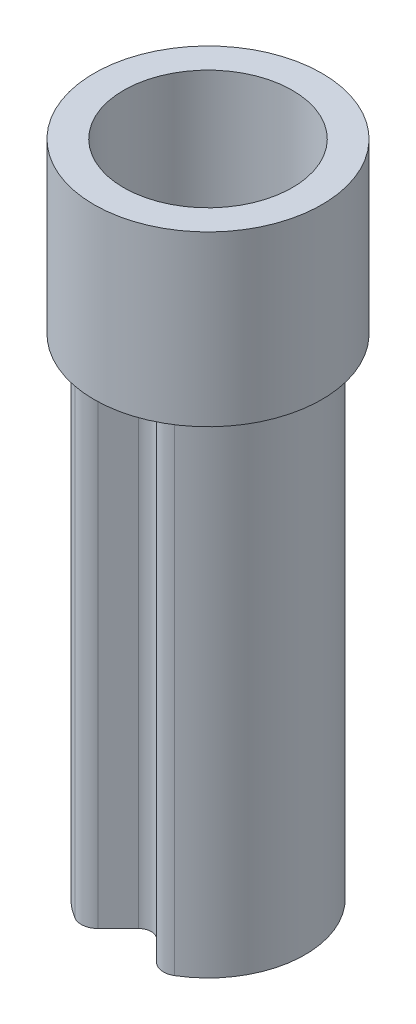
ISO-10303-21;
HEADER;
FILE_DESCRIPTION(('STEP AP214'),'2;1');
FILE_NAME('part.step','',(''),(''),'','','');
FILE_SCHEMA(('AUTOMOTIVE_DESIGN { 1 0 10303 214 1 1 1 1 }'));
ENDSEC;
DATA;
#1=APPLICATION_CONTEXT('core data for automotive mechanical design processes');
#2=APPLICATION_PROTOCOL_DEFINITION('international standard','automotive_design',2000,#1);
#3=PRODUCT_CONTEXT('',#1,'mechanical');
#4=PRODUCT('Part','Part','',(#3));
#5=PRODUCT_RELATED_PRODUCT_CATEGORY('part','',(#4));
#6=PRODUCT_DEFINITION_FORMATION('','',#4);
#7=PRODUCT_DEFINITION_CONTEXT('part definition',#1,'design');
#8=PRODUCT_DEFINITION('design','',#6,#7);
#9=PRODUCT_DEFINITION_SHAPE('','',#8);
#10=(LENGTH_UNIT() NAMED_UNIT(*) SI_UNIT(.MILLI.,.METRE.));
#11=(NAMED_UNIT(*) PLANE_ANGLE_UNIT() SI_UNIT($,.RADIAN.));
#12=(NAMED_UNIT(*) SI_UNIT($,.STERADIAN.) SOLID_ANGLE_UNIT());
#13=UNCERTAINTY_MEASURE_WITH_UNIT(LENGTH_MEASURE(1.E-05),#10,'distance_accuracy_value','');
#14=(GEOMETRIC_REPRESENTATION_CONTEXT(3) GLOBAL_UNCERTAINTY_ASSIGNED_CONTEXT((#13)) GLOBAL_UNIT_ASSIGNED_CONTEXT((#10,
#11,#12)) REPRESENTATION_CONTEXT('',''));
#15=CARTESIAN_POINT('',(0.,0.,0.));
#16=DIRECTION('',(0.,0.,1.));
#17=DIRECTION('',(1.,0.,0.));
#18=AXIS2_PLACEMENT_3D('',#15,#16,#17);
#19=CARTESIAN_POINT('',(0.,5.8,0.822132034355964));
#20=DIRECTION('',(0.,1.,0.));
#21=DIRECTION('',(0.,0.,1.));
#22=AXIS2_PLACEMENT_3D('',#19,#20,#21);
#23=PLANE('',#22);
#24=DIRECTION('',(0.707106781186548,0.,0.707106781186548));
#25=VECTOR('',#24,1.);
#26=CARTESIAN_POINT('',(0.106066017177983,5.8,0.716066017177983));
#27=LINE('',#26,#25);
#28=CARTESIAN_POINT('',(0.106066017177983,5.8,0.716066017177983));
#29=VERTEX_POINT('',#28);
#30=CARTESIAN_POINT('',(0.332945922473057,5.8,0.942945922473057));
#31=VERTEX_POINT('',#30);
#32=EDGE_CURVE('E154',#29,#31,#27,.T.);
#33=ORIENTED_EDGE('',*,*,#32,.T.);
#34=CARTESIAN_POINT('',(0.,5.8,0.));
#35=DIRECTION('',(0.,1.,0.));
#36=DIRECTION('',(0.,0.,1.));
#37=AXIS2_PLACEMENT_3D('',#34,#35,#36);
#38=CIRCLE('',#37,1.);
#39=CARTESIAN_POINT('',(0.513633561053512,5.8,0.858009653185492));
#40=VERTEX_POINT('',#39);
#41=EDGE_CURVE('E137',#31,#40,#38,.T.);
#42=ORIENTED_EDGE('',*,*,#41,.T.);
#43=CARTESIAN_POINT('',(0.487951883000837,5.8,0.815109170526217));
#44=DIRECTION('',(0.,1.,0.));
#45=DIRECTION('',(0.,0.,1.));
#46=AXIS2_PLACEMENT_3D('',#43,#44,#45);
#47=CIRCLE('',#46,0.05);
#48=CARTESIAN_POINT('',(0.452596543941509,5.8,0.850464509585545));
#49=VERTEX_POINT('',#48);
#50=EDGE_CURVE('E194',#40,#49,#47,.F.);
#51=ORIENTED_EDGE('',*,*,#50,.T.);
#52=DIRECTION('',(0.707106781186548,0.,0.707106781186547));
#53=VECTOR('',#52,1.);
#54=CARTESIAN_POINT('',(0.212132034355966,5.8,0.610000000000001));
#55=LINE('',#54,#53);
#56=CARTESIAN_POINT('',(0.212132034355966,5.8,0.610000000000002));
#57=VERTEX_POINT('',#56);
#58=EDGE_CURVE('E227',#57,#49,#55,.T.);
#59=ORIENTED_EDGE('',*,*,#58,.F.);
#60=CARTESIAN_POINT('',(0.,5.8,0.822132034355964));
#61=DIRECTION('',(0.,-1.,0.));
#62=DIRECTION('',(0.,0.,1.));
#63=AXIS2_PLACEMENT_3D('',#60,#61,#62);
#64=CIRCLE('',#63,0.3);
#65=CARTESIAN_POINT('',(-0.212132034355965,5.8,0.610000000000001));
#66=VERTEX_POINT('',#65);
#67=EDGE_CURVE('E223',#66,#57,#64,.T.);
#68=ORIENTED_EDGE('',*,*,#67,.F.);
#69=DIRECTION('',(0.707106781186547,0.,-0.707106781186548));
#70=VECTOR('',#69,1.);
#71=CARTESIAN_POINT('',(-0.479612456619358,5.8,0.877480422263394));
#72=LINE('',#71,#70);
#73=CARTESIAN_POINT('',(-0.452596543941509,5.8,0.850464509585545));
#74=VERTEX_POINT('',#73);
#75=EDGE_CURVE('E221',#74,#66,#72,.T.);
#76=ORIENTED_EDGE('',*,*,#75,.F.);
#77=CARTESIAN_POINT('',(-0.487951883000836,5.8,0.815109170526218));
#78=DIRECTION('',(0.,1.,0.));
#79=DIRECTION('',(0.,0.,1.));
#80=AXIS2_PLACEMENT_3D('',#77,#78,#79);
#81=CIRCLE('',#80,0.05);
#82=CARTESIAN_POINT('',(-0.513633561053512,5.8,0.858009653185492));
#83=VERTEX_POINT('',#82);
#84=EDGE_CURVE('E197',#74,#83,#81,.F.);
#85=ORIENTED_EDGE('',*,*,#84,.T.);
#86=CARTESIAN_POINT('',(-0.332945922473057,5.8,0.942945922473057));
#87=VERTEX_POINT('',#86);
#88=EDGE_CURVE('E12',#83,#87,#38,.T.);
#89=ORIENTED_EDGE('',*,*,#88,.T.);
#90=DIRECTION('',(0.707106781186547,0.,-0.707106781186548));
#91=VECTOR('',#90,1.);
#92=CARTESIAN_POINT('',(-0.448807004477936,5.8,1.05880700447794));
#93=LINE('',#92,#91);
#94=CARTESIAN_POINT('',(-0.106066017177983,5.8,0.716066017177983));
#95=VERTEX_POINT('',#94);
#96=EDGE_CURVE('E164',#87,#95,#93,.T.);
#97=ORIENTED_EDGE('',*,*,#96,.T.);
#98=CARTESIAN_POINT('',(0.,5.8,0.822132034355964));
#99=DIRECTION('',(0.,-1.,0.));
#100=DIRECTION('',(0.,0.,1.));
#101=AXIS2_PLACEMENT_3D('',#98,#99,#100);
#102=CIRCLE('',#101,0.15);
#103=EDGE_CURVE('E159',#95,#29,#102,.T.);
#104=ORIENTED_EDGE('',*,*,#103,.T.);
#105=EDGE_LOOP('',(#33,#42,#51,#59,#68,#76,#85,#89,#97,#104));
#106=FACE_BOUND('',#105,.T.);
#107=ADVANCED_FACE('F36',(#106),#23,.T.);
#108=CARTESIAN_POINT('',(0.,0.,0.822132034355964));
#109=DIRECTION('',(0.,1.,0.));
#110=DIRECTION('',(0.,0.,1.));
#111=AXIS2_PLACEMENT_3D('',#108,#109,#110);
#112=PLANE('',#111);
#113=CARTESIAN_POINT('',(0.,0.,0.));
#114=DIRECTION('',(0.,1.,0.));
#115=DIRECTION('',(0.,0.,1.));
#116=AXIS2_PLACEMENT_3D('',#113,#114,#115);
#117=CIRCLE('',#116,1.15);
#118=CARTESIAN_POINT('',(0.590678595211539,0.,0.986711101163316));
#119=VERTEX_POINT('',#118);
#120=CARTESIAN_POINT('',(-0.590678595211538,0.,0.986711101163316));
#121=VERTEX_POINT('',#120);
#122=EDGE_CURVE('E177',#119,#121,#117,.T.);
#123=ORIENTED_EDGE('',*,*,#122,.F.);
#124=CARTESIAN_POINT('',(0.487951883000836,0.,0.815109170526217));
#125=DIRECTION('',(0.,1.,0.));
#126=DIRECTION('',(0.,0.,1.));
#127=AXIS2_PLACEMENT_3D('',#124,#125,#126);
#128=CIRCLE('',#127,0.2);
#129=CARTESIAN_POINT('',(0.346530526763527,0.,0.956530526763527));
#130=VERTEX_POINT('',#129);
#131=EDGE_CURVE('E61',#119,#130,#128,.F.);
#132=ORIENTED_EDGE('',*,*,#131,.T.);
#133=DIRECTION('',(0.707106781186548,0.,0.707106781186548));
#134=VECTOR('',#133,1.);
#135=CARTESIAN_POINT('',(0.106066017177983,0.,0.716066017177983));
#136=LINE('',#135,#134);
#137=CARTESIAN_POINT('',(0.106066017177983,0.,0.716066017177983));
#138=VERTEX_POINT('',#137);
#139=EDGE_CURVE('E174',#138,#130,#136,.T.);
#140=ORIENTED_EDGE('',*,*,#139,.F.);
#141=CARTESIAN_POINT('',(0.,0.,0.822132034355964));
#142=DIRECTION('',(0.,-1.,0.));
#143=DIRECTION('',(0.,0.,1.));
#144=AXIS2_PLACEMENT_3D('',#141,#142,#143);
#145=CIRCLE('',#144,0.15);
#146=CARTESIAN_POINT('',(-0.106066017177983,0.,0.716066017177983));
#147=VERTEX_POINT('',#146);
#148=EDGE_CURVE('E171',#147,#138,#145,.T.);
#149=ORIENTED_EDGE('',*,*,#148,.F.);
#150=DIRECTION('',(0.707106781186547,0.,-0.707106781186548));
#151=VECTOR('',#150,1.);
#152=CARTESIAN_POINT('',(-0.448807004477936,0.,1.05880700447794));
#153=LINE('',#152,#151);
#154=CARTESIAN_POINT('',(-0.346530526763527,0.,0.956530526763527));
#155=VERTEX_POINT('',#154);
#156=EDGE_CURVE('E180',#155,#147,#153,.T.);
#157=ORIENTED_EDGE('',*,*,#156,.F.);
#158=CARTESIAN_POINT('',(-0.487951883000836,0.,0.815109170526218));
#159=DIRECTION('',(0.,1.,0.));
#160=DIRECTION('',(0.,0.,1.));
#161=AXIS2_PLACEMENT_3D('',#158,#159,#160);
#162=CIRCLE('',#161,0.2);
#163=EDGE_CURVE('E204',#155,#121,#162,.F.);
#164=ORIENTED_EDGE('',*,*,#163,.T.);
#165=EDGE_LOOP('',(#123,#132,#140,#149,#157,#164));
#166=FACE_BOUND('',#165,.T.);
#167=DIRECTION('',(0.707106781186548,0.,0.707106781186547));
#168=VECTOR('',#167,1.);
#169=CARTESIAN_POINT('',(0.212132034355966,0.,0.610000000000001));
#170=LINE('',#169,#168);
#171=CARTESIAN_POINT('',(0.212132034355966,0.,0.610000000000002));
#172=VERTEX_POINT('',#171);
#173=CARTESIAN_POINT('',(0.452596543941509,0.,0.850464509585545));
#174=VERTEX_POINT('',#173);
#175=EDGE_CURVE('E224',#172,#174,#170,.T.);
#176=ORIENTED_EDGE('',*,*,#175,.T.);
#177=CARTESIAN_POINT('',(0.487951883000837,0.,0.815109170526217));
#178=DIRECTION('',(0.,1.,0.));
#179=DIRECTION('',(0.,0.,1.));
#180=AXIS2_PLACEMENT_3D('',#177,#178,#179);
#181=CIRCLE('',#180,0.05);
#182=CARTESIAN_POINT('',(0.513633561053512,0.,0.858009653185492));
#183=VERTEX_POINT('',#182);
#184=EDGE_CURVE('E192',#174,#183,#181,.T.);
#185=ORIENTED_EDGE('',*,*,#184,.T.);
#186=CARTESIAN_POINT('',(0.,0.,0.));
#187=DIRECTION('',(0.,1.,0.));
#188=DIRECTION('',(0.,0.,1.));
#189=AXIS2_PLACEMENT_3D('',#186,#187,#188);
#190=CIRCLE('',#189,1.);
#191=CARTESIAN_POINT('',(-0.513633561053512,0.,0.858009653185492));
#192=VERTEX_POINT('',#191);
#193=EDGE_CURVE('E231',#183,#192,#190,.T.);
#194=ORIENTED_EDGE('',*,*,#193,.T.);
#195=CARTESIAN_POINT('',(-0.487951883000836,0.,0.815109170526218));
#196=DIRECTION('',(0.,1.,0.));
#197=DIRECTION('',(0.,0.,1.));
#198=AXIS2_PLACEMENT_3D('',#195,#196,#197);
#199=CIRCLE('',#198,0.05);
#200=CARTESIAN_POINT('',(-0.452596543941509,0.,0.850464509585545));
#201=VERTEX_POINT('',#200);
#202=EDGE_CURVE('E195',#192,#201,#199,.T.);
#203=ORIENTED_EDGE('',*,*,#202,.T.);
#204=DIRECTION('',(0.707106781186547,0.,-0.707106781186548));
#205=VECTOR('',#204,1.);
#206=CARTESIAN_POINT('',(-0.479612456619358,0.,0.877480422263394));
#207=LINE('',#206,#205);
#208=CARTESIAN_POINT('',(-0.212132034355965,0.,0.610000000000001));
#209=VERTEX_POINT('',#208);
#210=EDGE_CURVE('E234',#201,#209,#207,.T.);
#211=ORIENTED_EDGE('',*,*,#210,.T.);
#212=CARTESIAN_POINT('',(0.,0.,0.822132034355964));
#213=DIRECTION('',(0.,-1.,0.));
#214=DIRECTION('',(0.,0.,1.));
#215=AXIS2_PLACEMENT_3D('',#212,#213,#214);
#216=CIRCLE('',#215,0.3);
#217=EDGE_CURVE('E237',#209,#172,#216,.T.);
#218=ORIENTED_EDGE('',*,*,#217,.T.);
#219=EDGE_LOOP('',(#176,#185,#194,#203,#211,#218));
#220=FACE_BOUND('',#219,.T.);
#221=ADVANCED_FACE('F255',(#166,#220),#112,.F.);
#222=CARTESIAN_POINT('',(0.,5.8,0.822132034355964));
#223=DIRECTION('',(0.,-1.,0.));
#224=DIRECTION('',(0.,0.,-1.));
#225=AXIS2_PLACEMENT_3D('',#222,#223,#224);
#226=CYLINDRICAL_SURFACE('',#225,0.15);
#227=ORIENTED_EDGE('',*,*,#148,.T.);
#228=DIRECTION('',(0.,-1.,0.));
#229=VECTOR('',#228,1.);
#230=CARTESIAN_POINT('',(0.106066017177983,5.8,0.716066017177983));
#231=LINE('',#230,#229);
#232=EDGE_CURVE('E184',#29,#138,#231,.T.);
#233=ORIENTED_EDGE('',*,*,#232,.F.);
#234=ORIENTED_EDGE('',*,*,#103,.F.);
#235=DIRECTION('',(0.,-1.,0.));
#236=VECTOR('',#235,1.);
#237=CARTESIAN_POINT('',(-0.106066017177983,5.8,0.716066017177983));
#238=LINE('',#237,#236);
#239=EDGE_CURVE('E170',#95,#147,#238,.T.);
#240=ORIENTED_EDGE('',*,*,#239,.T.);
#241=EDGE_LOOP('',(#227,#233,#234,#240));
#242=FACE_BOUND('',#241,.T.);
#243=ADVANCED_FACE('F291',(#242),#226,.F.);
#244=CARTESIAN_POINT('',(0.106066017177983,5.8,0.716066017177983));
#245=DIRECTION('',(0.707106781186547,0.,-0.707106781186547));
#246=DIRECTION('',(-0.707106781186548,0.,-0.707106781186548));
#247=AXIS2_PLACEMENT_3D('',#244,#245,#246);
#248=PLANE('',#247);
#249=ORIENTED_EDGE('',*,*,#139,.T.);
#250=DIRECTION('',(0.,-1.,0.));
#251=VECTOR('',#250,1.);
#252=CARTESIAN_POINT('',(0.346530526763527,5.8,0.956530526763527));
#253=LINE('',#252,#251);
#254=CARTESIAN_POINT('',(0.346530526763527,5.8,0.956530526763527));
#255=VERTEX_POINT('',#254);
#256=EDGE_CURVE('E157',#130,#255,#253,.F.);
#257=ORIENTED_EDGE('',*,*,#256,.T.);
#258=EDGE_CURVE('E133',#31,#255,#27,.T.);
#259=ORIENTED_EDGE('',*,*,#258,.F.);
#260=ORIENTED_EDGE('',*,*,#32,.F.);
#261=ORIENTED_EDGE('',*,*,#232,.T.);
#262=EDGE_LOOP('',(#249,#257,#259,#260,#261));
#263=FACE_BOUND('',#262,.T.);
#264=ADVANCED_FACE('F152',(#263),#248,.F.);
#265=CARTESIAN_POINT('',(0.,5.8,0.));
#266=DIRECTION('',(0.,-1.,0.));
#267=DIRECTION('',(0.,0.,-1.));
#268=AXIS2_PLACEMENT_3D('',#265,#266,#267);
#269=CYLINDRICAL_SURFACE('',#268,1.15);
#270=CARTESIAN_POINT('',(0.,5.8,0.));
#271=DIRECTION('',(0.,1.,0.));
#272=DIRECTION('',(0.,0.,1.));
#273=AXIS2_PLACEMENT_3D('',#270,#271,#272);
#274=CIRCLE('',#273,1.15);
#275=CARTESIAN_POINT('',(0.590678595211539,5.8,0.986711101163316));
#276=VERTEX_POINT('',#275);
#277=CARTESIAN_POINT('',(-0.590678595211538,5.8,0.986711101163316));
#278=VERTEX_POINT('',#277);
#279=EDGE_CURVE('E163',#276,#278,#274,.T.);
#280=ORIENTED_EDGE('',*,*,#279,.F.);
#281=DIRECTION('',(0.,-1.,0.));
#282=VECTOR('',#281,1.);
#283=CARTESIAN_POINT('',(0.590678595211539,5.8,0.986711101163316));
#284=LINE('',#283,#282);
#285=EDGE_CURVE('E201',#276,#119,#284,.T.);
#286=ORIENTED_EDGE('',*,*,#285,.T.);
#287=ORIENTED_EDGE('',*,*,#122,.T.);
#288=DIRECTION('',(0.,-1.,0.));
#289=VECTOR('',#288,1.);
#290=CARTESIAN_POINT('',(-0.590678595211539,5.8,0.986711101163316));
#291=LINE('',#290,#289);
#292=EDGE_CURVE('E198',#121,#278,#291,.F.);
#293=ORIENTED_EDGE('',*,*,#292,.T.);
#294=EDGE_LOOP('',(#280,#286,#287,#293));
#295=FACE_BOUND('',#294,.T.);
#296=ADVANCED_FACE('F299',(#295),#269,.T.);
#297=CARTESIAN_POINT('',(-0.448807004477936,5.8,1.05880700447794));
#298=DIRECTION('',(-0.707106781186548,0.,-0.707106781186547));
#299=DIRECTION('',(-0.707106781186547,0.,0.707106781186548));
#300=AXIS2_PLACEMENT_3D('',#297,#298,#299);
#301=PLANE('',#300);
#302=CARTESIAN_POINT('',(-0.346530526763527,5.8,0.956530526763527));
#303=VERTEX_POINT('',#302);
#304=EDGE_CURVE('E136',#303,#87,#93,.T.);
#305=ORIENTED_EDGE('',*,*,#304,.F.);
#306=DIRECTION('',(0.,-1.,0.));
#307=VECTOR('',#306,1.);
#308=CARTESIAN_POINT('',(-0.346530526763527,5.8,0.956530526763527));
#309=LINE('',#308,#307);
#310=EDGE_CURVE('E45',#303,#155,#309,.T.);
#311=ORIENTED_EDGE('',*,*,#310,.T.);
#312=ORIENTED_EDGE('',*,*,#156,.T.);
#313=ORIENTED_EDGE('',*,*,#239,.F.);
#314=ORIENTED_EDGE('',*,*,#96,.F.);
#315=EDGE_LOOP('',(#305,#311,#312,#313,#314));
#316=FACE_BOUND('',#315,.T.);
#317=ADVANCED_FACE('F296',(#316),#301,.F.);
#318=CARTESIAN_POINT('',(0.,5.8,0.));
#319=DIRECTION('',(0.,-1.,0.));
#320=DIRECTION('',(0.,0.,-1.));
#321=AXIS2_PLACEMENT_3D('',#318,#319,#320);
#322=CYLINDRICAL_SURFACE('',#321,1.);
#323=ORIENTED_EDGE('',*,*,#193,.F.);
#324=DIRECTION('',(0.,-1.,0.));
#325=VECTOR('',#324,1.);
#326=CARTESIAN_POINT('',(0.513633561053512,5.8,0.858009653185492));
#327=LINE('',#326,#325);
#328=EDGE_CURVE('E145',#183,#40,#327,.F.);
#329=ORIENTED_EDGE('',*,*,#328,.T.);
#330=ORIENTED_EDGE('',*,*,#41,.F.);
#331=EDGE_CURVE('E53',#87,#31,#38,.T.);
#332=ORIENTED_EDGE('',*,*,#331,.F.);
#333=ORIENTED_EDGE('',*,*,#88,.F.);
#334=DIRECTION('',(0.,-1.,0.));
#335=VECTOR('',#334,1.);
#336=CARTESIAN_POINT('',(-0.513633561053512,5.8,0.858009653185492));
#337=LINE('',#336,#335);
#338=EDGE_CURVE('E189',#83,#192,#337,.T.);
#339=ORIENTED_EDGE('',*,*,#338,.T.);
#340=EDGE_LOOP('',(#323,#329,#330,#332,#333,#339));
#341=FACE_BOUND('',#340,.T.);
#342=CARTESIAN_POINT('',(0.,7.8,0.));
#343=DIRECTION('',(0.,1.,0.));
#344=DIRECTION('',(0.,0.,1.));
#345=AXIS2_PLACEMENT_3D('',#342,#343,#344);
#346=CIRCLE('',#345,1.);
#347=CARTESIAN_POINT('',(0.,7.8,1.));
#348=VERTEX_POINT('',#347);
#349=EDGE_CURVE('E138',#348,#348,#346,.T.);
#350=ORIENTED_EDGE('',*,*,#349,.T.);
#351=EDGE_LOOP('',(#350));
#352=FACE_BOUND('',#351,.T.);
#353=ADVANCED_FACE('F142',(#341,#352),#322,.F.);
#354=CARTESIAN_POINT('',(-0.479612456619358,5.8,0.877480422263394));
#355=DIRECTION('',(-0.707106781186548,0.,-0.707106781186547));
#356=DIRECTION('',(-0.707106781186547,0.,0.707106781186548));
#357=AXIS2_PLACEMENT_3D('',#354,#355,#356);
#358=PLANE('',#357);
#359=ORIENTED_EDGE('',*,*,#210,.F.);
#360=DIRECTION('',(0.,1.,0.));
#361=VECTOR('',#360,1.);
#362=CARTESIAN_POINT('',(-0.452596543941509,5.8,0.850464509585545));
#363=LINE('',#362,#361);
#364=EDGE_CURVE('E190',#201,#74,#363,.T.);
#365=ORIENTED_EDGE('',*,*,#364,.T.);
#366=ORIENTED_EDGE('',*,*,#75,.T.);
#367=DIRECTION('',(0.,-1.,0.));
#368=VECTOR('',#367,1.);
#369=CARTESIAN_POINT('',(-0.212132034355965,5.8,0.610000000000001));
#370=LINE('',#369,#368);
#371=EDGE_CURVE('E175',#66,#209,#370,.T.);
#372=ORIENTED_EDGE('',*,*,#371,.T.);
#373=EDGE_LOOP('',(#359,#365,#366,#372));
#374=FACE_BOUND('',#373,.T.);
#375=ADVANCED_FACE('F247',(#374),#358,.T.);
#376=CARTESIAN_POINT('',(0.,5.8,0.822132034355964));
#377=DIRECTION('',(0.,-1.,0.));
#378=DIRECTION('',(0.,0.,-1.));
#379=AXIS2_PLACEMENT_3D('',#376,#377,#378);
#380=CYLINDRICAL_SURFACE('',#379,0.3);
#381=ORIENTED_EDGE('',*,*,#217,.F.);
#382=ORIENTED_EDGE('',*,*,#371,.F.);
#383=ORIENTED_EDGE('',*,*,#67,.T.);
#384=DIRECTION('',(0.,-1.,0.));
#385=VECTOR('',#384,1.);
#386=CARTESIAN_POINT('',(0.212132034355966,5.8,0.610000000000002));
#387=LINE('',#386,#385);
#388=EDGE_CURVE('E230',#57,#172,#387,.T.);
#389=ORIENTED_EDGE('',*,*,#388,.T.);
#390=EDGE_LOOP('',(#381,#382,#383,#389));
#391=FACE_BOUND('',#390,.T.);
#392=ADVANCED_FACE('F252',(#391),#380,.T.);
#393=CARTESIAN_POINT('',(0.212132034355966,5.8,0.610000000000001));
#394=DIRECTION('',(0.707106781186547,0.,-0.707106781186548));
#395=DIRECTION('',(-0.707106781186548,0.,-0.707106781186547));
#396=AXIS2_PLACEMENT_3D('',#393,#394,#395);
#397=PLANE('',#396);
#398=ORIENTED_EDGE('',*,*,#58,.T.);
#399=DIRECTION('',(0.,1.,0.));
#400=VECTOR('',#399,1.);
#401=CARTESIAN_POINT('',(0.452596543941509,0.,0.850464509585545));
#402=LINE('',#401,#400);
#403=EDGE_CURVE('E186',#49,#174,#402,.F.);
#404=ORIENTED_EDGE('',*,*,#403,.T.);
#405=ORIENTED_EDGE('',*,*,#175,.F.);
#406=ORIENTED_EDGE('',*,*,#388,.F.);
#407=EDGE_LOOP('',(#398,#404,#405,#406));
#408=FACE_BOUND('',#407,.T.);
#409=ADVANCED_FACE('F274',(#408),#397,.T.);
#410=CARTESIAN_POINT('',(0.487951883000837,5.8,0.815109170526217));
#411=DIRECTION('',(0.,-1.,0.));
#412=DIRECTION('',(0.,0.,-1.));
#413=AXIS2_PLACEMENT_3D('',#410,#411,#412);
#414=CYLINDRICAL_SURFACE('',#413,0.05);
#415=ORIENTED_EDGE('',*,*,#50,.F.);
#416=ORIENTED_EDGE('',*,*,#328,.F.);
#417=ORIENTED_EDGE('',*,*,#184,.F.);
#418=ORIENTED_EDGE('',*,*,#403,.F.);
#419=EDGE_LOOP('',(#415,#416,#417,#418));
#420=FACE_BOUND('',#419,.T.);
#421=ADVANCED_FACE('F275',(#420),#414,.F.);
#422=CARTESIAN_POINT('',(-0.487951883000836,5.8,0.815109170526218));
#423=DIRECTION('',(0.,-1.,0.));
#424=DIRECTION('',(0.,0.,-1.));
#425=AXIS2_PLACEMENT_3D('',#422,#423,#424);
#426=CYLINDRICAL_SURFACE('',#425,0.05);
#427=ORIENTED_EDGE('',*,*,#84,.F.);
#428=ORIENTED_EDGE('',*,*,#364,.F.);
#429=ORIENTED_EDGE('',*,*,#202,.F.);
#430=ORIENTED_EDGE('',*,*,#338,.F.);
#431=EDGE_LOOP('',(#427,#428,#429,#430));
#432=FACE_BOUND('',#431,.T.);
#433=ADVANCED_FACE('F260',(#432),#426,.F.);
#434=CARTESIAN_POINT('',(0.487951883000836,5.8,0.815109170526217));
#435=DIRECTION('',(0.,-1.,0.));
#436=DIRECTION('',(0.,0.,-1.));
#437=AXIS2_PLACEMENT_3D('',#434,#435,#436);
#438=CYLINDRICAL_SURFACE('',#437,0.2);
#439=CARTESIAN_POINT('',(0.487951883000836,5.8,0.815109170526217));
#440=DIRECTION('',(0.,1.,0.));
#441=DIRECTION('',(0.,0.,1.));
#442=AXIS2_PLACEMENT_3D('',#439,#440,#441);
#443=CIRCLE('',#442,0.2);
#444=EDGE_CURVE('E210',#255,#276,#443,.T.);
#445=ORIENTED_EDGE('',*,*,#444,.F.);
#446=ORIENTED_EDGE('',*,*,#256,.F.);
#447=ORIENTED_EDGE('',*,*,#131,.F.);
#448=ORIENTED_EDGE('',*,*,#285,.F.);
#449=EDGE_LOOP('',(#445,#446,#447,#448));
#450=FACE_BOUND('',#449,.T.);
#451=ADVANCED_FACE('F282',(#450),#438,.T.);
#452=CARTESIAN_POINT('',(-0.487951883000836,5.8,0.815109170526218));
#453=DIRECTION('',(0.,-1.,0.));
#454=DIRECTION('',(0.,0.,-1.));
#455=AXIS2_PLACEMENT_3D('',#452,#453,#454);
#456=CYLINDRICAL_SURFACE('',#455,0.2);
#457=CARTESIAN_POINT('',(-0.487951883000836,5.8,0.815109170526218));
#458=DIRECTION('',(0.,1.,0.));
#459=DIRECTION('',(0.,0.,1.));
#460=AXIS2_PLACEMENT_3D('',#457,#458,#459);
#461=CIRCLE('',#460,0.2);
#462=EDGE_CURVE('E208',#278,#303,#461,.T.);
#463=ORIENTED_EDGE('',*,*,#462,.F.);
#464=ORIENTED_EDGE('',*,*,#292,.F.);
#465=ORIENTED_EDGE('',*,*,#163,.F.);
#466=ORIENTED_EDGE('',*,*,#310,.F.);
#467=EDGE_LOOP('',(#463,#464,#465,#466));
#468=FACE_BOUND('',#467,.T.);
#469=ADVANCED_FACE('F38',(#468),#456,.T.);
#470=CARTESIAN_POINT('',(0.,5.8,0.));
#471=DIRECTION('',(0.,1.,0.));
#472=DIRECTION('',(0.,0.,1.));
#473=AXIS2_PLACEMENT_3D('',#470,#471,#472);
#474=PLANE('',#473);
#475=CARTESIAN_POINT('',(0.,5.8,0.));
#476=DIRECTION('',(0.,1.,0.));
#477=DIRECTION('',(0.,0.,1.));
#478=AXIS2_PLACEMENT_3D('',#475,#476,#477);
#479=CIRCLE('',#478,1.35);
#480=CARTESIAN_POINT('',(0.,5.8,1.35));
#481=VERTEX_POINT('',#480);
#482=EDGE_CURVE('E149',#481,#481,#479,.T.);
#483=ORIENTED_EDGE('',*,*,#482,.F.);
#484=EDGE_LOOP('',(#483));
#485=FACE_BOUND('',#484,.T.);
#486=ORIENTED_EDGE('',*,*,#331,.T.);
#487=ORIENTED_EDGE('',*,*,#258,.T.);
#488=ORIENTED_EDGE('',*,*,#444,.T.);
#489=ORIENTED_EDGE('',*,*,#279,.T.);
#490=ORIENTED_EDGE('',*,*,#462,.T.);
#491=ORIENTED_EDGE('',*,*,#304,.T.);
#492=EDGE_LOOP('',(#486,#487,#488,#489,#490,#491));
#493=FACE_BOUND('',#492,.T.);
#494=ADVANCED_FACE('F131',(#485,#493),#474,.F.);
#495=CARTESIAN_POINT('',(0.,19.4183766184074,0.));
#496=DIRECTION('',(0.,-1.,0.));
#497=DIRECTION('',(0.,0.,-1.));
#498=AXIS2_PLACEMENT_3D('',#495,#496,#497);
#499=CYLINDRICAL_SURFACE('',#498,1.35);
#500=ORIENTED_EDGE('',*,*,#482,.T.);
#501=EDGE_LOOP('',(#500));
#502=FACE_BOUND('',#501,.T.);
#503=CARTESIAN_POINT('',(0.,7.8,0.));
#504=DIRECTION('',(0.,1.,0.));
#505=DIRECTION('',(0.,0.,1.));
#506=AXIS2_PLACEMENT_3D('',#503,#504,#505);
#507=CIRCLE('',#506,1.35);
#508=CARTESIAN_POINT('',(0.,7.8,1.35));
#509=VERTEX_POINT('',#508);
#510=EDGE_CURVE('E235',#509,#509,#507,.T.);
#511=ORIENTED_EDGE('',*,*,#510,.F.);
#512=EDGE_LOOP('',(#511));
#513=FACE_BOUND('',#512,.T.);
#514=ADVANCED_FACE('F325',(#502,#513),#499,.T.);
#515=CARTESIAN_POINT('',(0.,7.8,0.822132034355964));
#516=DIRECTION('',(0.,1.,0.));
#517=DIRECTION('',(0.,0.,1.));
#518=AXIS2_PLACEMENT_3D('',#515,#516,#517);
#519=PLANE('',#518);
#520=ORIENTED_EDGE('',*,*,#349,.F.);
#521=EDGE_LOOP('',(#520));
#522=FACE_BOUND('',#521,.T.);
#523=ORIENTED_EDGE('',*,*,#510,.T.);
#524=EDGE_LOOP('',(#523));
#525=FACE_BOUND('',#524,.T.);
#526=ADVANCED_FACE('F407',(#522,#525),#519,.T.);
#527=CLOSED_SHELL('',(#107,#221,#243,#264,#296,#317,#353,#375,#392,#409,#421,#433,#451,#469,
#494,#514,#526));
#528=MANIFOLD_SOLID_BREP('B2',#527);
#529=ADVANCED_BREP_SHAPE_REPRESENTATION('',(#18,#528),#14);
#530=SHAPE_DEFINITION_REPRESENTATION(#9,#529);
ENDSEC;
END-ISO-10303-21;
